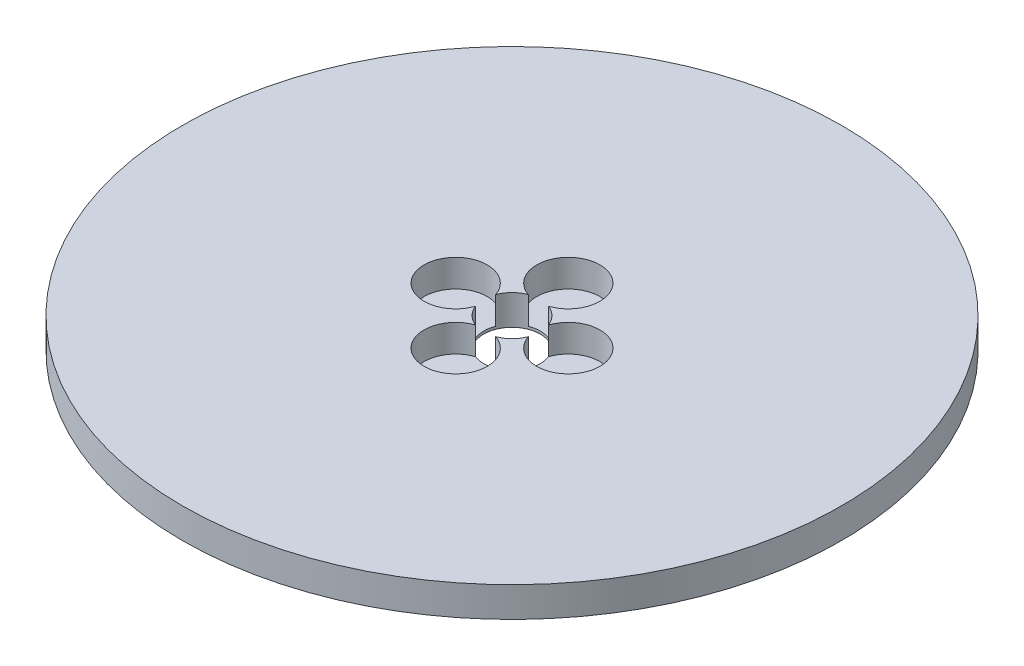
ISO-10303-21;
HEADER;
FILE_DESCRIPTION(('STEP AP214'),'2;1');
FILE_NAME('part.step','',(''),(''),'','','');
FILE_SCHEMA(('AUTOMOTIVE_DESIGN { 1 0 10303 214 1 1 1 1 }'));
ENDSEC;
DATA;
#1=APPLICATION_CONTEXT('core data for automotive mechanical design processes');
#2=APPLICATION_PROTOCOL_DEFINITION('international standard','automotive_design',2000,#1);
#3=PRODUCT_CONTEXT('',#1,'mechanical');
#4=PRODUCT('Part','Part','',(#3));
#5=PRODUCT_RELATED_PRODUCT_CATEGORY('part','',(#4));
#6=PRODUCT_DEFINITION_FORMATION('','',#4);
#7=PRODUCT_DEFINITION_CONTEXT('part definition',#1,'design');
#8=PRODUCT_DEFINITION('design','',#6,#7);
#9=PRODUCT_DEFINITION_SHAPE('','',#8);
#10=(LENGTH_UNIT() NAMED_UNIT(*) SI_UNIT(.MILLI.,.METRE.));
#11=(NAMED_UNIT(*) PLANE_ANGLE_UNIT() SI_UNIT($,.RADIAN.));
#12=(NAMED_UNIT(*) SI_UNIT($,.STERADIAN.) SOLID_ANGLE_UNIT());
#13=UNCERTAINTY_MEASURE_WITH_UNIT(LENGTH_MEASURE(1.E-05),#10,'distance_accuracy_value','');
#14=(GEOMETRIC_REPRESENTATION_CONTEXT(3) GLOBAL_UNCERTAINTY_ASSIGNED_CONTEXT((#13)) GLOBAL_UNIT_ASSIGNED_CONTEXT((#10,
#11,#12)) REPRESENTATION_CONTEXT('',''));
#15=CARTESIAN_POINT('',(0.,0.,0.));
#16=DIRECTION('',(0.,0.,1.));
#17=DIRECTION('',(1.,0.,0.));
#18=AXIS2_PLACEMENT_3D('',#15,#16,#17);
#19=CARTESIAN_POINT('',(0.,8.,0.));
#20=DIRECTION('',(0.,-1.,0.));
#21=DIRECTION('',(0.,0.,-1.));
#22=AXIS2_PLACEMENT_3D('',#19,#20,#21);
#23=CYLINDRICAL_SURFACE('',#22,87.5);
#24=CARTESIAN_POINT('',(0.,8.,0.));
#25=DIRECTION('',(0.,1.,0.));
#26=DIRECTION('',(0.,0.,1.));
#27=AXIS2_PLACEMENT_3D('',#24,#25,#26);
#28=CIRCLE('',#27,87.5);
#29=CARTESIAN_POINT('',(0.,8.,87.5));
#30=VERTEX_POINT('',#29);
#31=EDGE_CURVE('E141',#30,#30,#28,.T.);
#32=ORIENTED_EDGE('',*,*,#31,.F.);
#33=EDGE_LOOP('',(#32));
#34=FACE_BOUND('',#33,.T.);
#35=CARTESIAN_POINT('',(0.,0.,0.));
#36=DIRECTION('',(0.,1.,0.));
#37=DIRECTION('',(0.,0.,1.));
#38=AXIS2_PLACEMENT_3D('',#35,#36,#37);
#39=CIRCLE('',#38,87.5);
#40=CARTESIAN_POINT('',(0.,0.,87.5));
#41=VERTEX_POINT('',#40);
#42=EDGE_CURVE('E135',#41,#41,#39,.T.);
#43=ORIENTED_EDGE('',*,*,#42,.T.);
#44=EDGE_LOOP('',(#43));
#45=FACE_BOUND('',#44,.T.);
#46=ADVANCED_FACE('F39',(#34,#45),#23,.T.);
#47=CARTESIAN_POINT('',(0.,8.,0.));
#48=DIRECTION('',(0.,1.,0.));
#49=DIRECTION('',(0.,0.,1.));
#50=AXIS2_PLACEMENT_3D('',#47,#48,#49);
#51=PLANE('',#50);
#52=CARTESIAN_POINT('',(14.9536666820935,8.,0.));
#53=DIRECTION('',(0.,1.,0.));
#54=DIRECTION('',(0.,0.,-1.));
#55=AXIS2_PLACEMENT_3D('',#52,#53,#54);
#56=CIRCLE('',#55,8.3883222143685);
#57=CARTESIAN_POINT('',(7.00491063900573,8.,2.67978113650057));
#58=VERTEX_POINT('',#57);
#59=CARTESIAN_POINT('',(7.00491063900573,8.,-2.67978113650057));
#60=VERTEX_POINT('',#59);
#61=EDGE_CURVE('E126',#58,#60,#56,.T.);
#62=ORIENTED_EDGE('',*,*,#61,.F.);
#63=CARTESIAN_POINT('',(0.,8.,0.));
#64=DIRECTION('',(0.,1.,0.));
#65=DIRECTION('',(0.,0.,1.));
#66=AXIS2_PLACEMENT_3D('',#63,#64,#65);
#67=CIRCLE('',#66,7.5);
#68=CARTESIAN_POINT('',(2.67978113650059,8.,7.00491063900572));
#69=VERTEX_POINT('',#68);
#70=EDGE_CURVE('E121',#69,#58,#67,.T.);
#71=ORIENTED_EDGE('',*,*,#70,.F.);
#72=CARTESIAN_POINT('',(0.,8.,14.9536666820935));
#73=DIRECTION('',(0.,1.,0.));
#74=DIRECTION('',(1.,0.,0.));
#75=AXIS2_PLACEMENT_3D('',#72,#73,#74);
#76=CIRCLE('',#75,8.3883222143685);
#77=CARTESIAN_POINT('',(-2.67978113650055,8.,7.00491063900574));
#78=VERTEX_POINT('',#77);
#79=EDGE_CURVE('E105',#78,#69,#76,.T.);
#80=ORIENTED_EDGE('',*,*,#79,.F.);
#81=CARTESIAN_POINT('',(-7.00491063900573,8.,2.67978113650057));
#82=VERTEX_POINT('',#81);
#83=EDGE_CURVE('E129',#82,#78,#67,.T.);
#84=ORIENTED_EDGE('',*,*,#83,.F.);
#85=CARTESIAN_POINT('',(-14.9536666820935,8.,0.));
#86=DIRECTION('',(0.,1.,0.));
#87=DIRECTION('',(0.,0.,1.));
#88=AXIS2_PLACEMENT_3D('',#85,#86,#87);
#89=CIRCLE('',#88,8.3883222143685);
#90=CARTESIAN_POINT('',(-7.00491063900573,8.,-2.67978113650057));
#91=VERTEX_POINT('',#90);
#92=EDGE_CURVE('E140',#91,#82,#89,.T.);
#93=ORIENTED_EDGE('',*,*,#92,.F.);
#94=CARTESIAN_POINT('',(-2.67978113650064,8.,-7.00491063900571));
#95=VERTEX_POINT('',#94);
#96=EDGE_CURVE('E132',#95,#91,#67,.T.);
#97=ORIENTED_EDGE('',*,*,#96,.F.);
#98=CARTESIAN_POINT('',(-1.56631344503429E-13,8.,-14.9536666820935));
#99=DIRECTION('',(0.,1.,0.));
#100=DIRECTION('',(-1.,0.,0.));
#101=AXIS2_PLACEMENT_3D('',#98,#99,#100);
#102=CIRCLE('',#101,8.3883222143685);
#103=CARTESIAN_POINT('',(2.6797811365005,8.,-7.00491063900576));
#104=VERTEX_POINT('',#103);
#105=EDGE_CURVE('E226',#104,#95,#102,.T.);
#106=ORIENTED_EDGE('',*,*,#105,.F.);
#107=EDGE_CURVE('E128',#60,#104,#67,.T.);
#108=ORIENTED_EDGE('',*,*,#107,.F.);
#109=EDGE_LOOP('',(#62,#71,#80,#84,#93,#97,#106,#108));
#110=FACE_BOUND('',#109,.T.);
#111=ORIENTED_EDGE('',*,*,#31,.T.);
#112=EDGE_LOOP('',(#111));
#113=FACE_BOUND('',#112,.T.);
#114=ADVANCED_FACE('F124',(#110,#113),#51,.T.);
#115=CARTESIAN_POINT('',(0.,0.,0.));
#116=DIRECTION('',(0.,1.,0.));
#117=DIRECTION('',(0.,0.,1.));
#118=AXIS2_PLACEMENT_3D('',#115,#116,#117);
#119=PLANE('',#118);
#120=CARTESIAN_POINT('',(0.,0.,0.));
#121=DIRECTION('',(0.,1.,0.));
#122=DIRECTION('',(0.,0.,1.));
#123=AXIS2_PLACEMENT_3D('',#120,#121,#122);
#124=CIRCLE('',#123,7.5);
#125=CARTESIAN_POINT('',(0.,0.,7.5));
#126=VERTEX_POINT('',#125);
#127=EDGE_CURVE('E138',#126,#126,#124,.T.);
#128=ORIENTED_EDGE('',*,*,#127,.T.);
#129=EDGE_LOOP('',(#128));
#130=FACE_BOUND('',#129,.T.);
#131=ORIENTED_EDGE('',*,*,#42,.F.);
#132=EDGE_LOOP('',(#131));
#133=FACE_BOUND('',#132,.T.);
#134=ADVANCED_FACE('F186',(#130,#133),#119,.F.);
#135=CARTESIAN_POINT('',(0.,8.,0.));
#136=DIRECTION('',(0.,-1.,0.));
#137=DIRECTION('',(0.,0.,-1.));
#138=AXIS2_PLACEMENT_3D('',#135,#136,#137);
#139=CYLINDRICAL_SURFACE('',#138,7.5);
#140=DIRECTION('',(0.,1.,0.));
#141=VECTOR('',#140,1.);
#142=CARTESIAN_POINT('',(7.00491063900573,4.35345535176546,2.67978113650057));
#143=LINE('',#142,#141);
#144=CARTESIAN_POINT('',(7.00491063900573,0.706910703530914,2.67978113650057));
#145=VERTEX_POINT('',#144);
#146=EDGE_CURVE('E11',#145,#58,#143,.T.);
#147=ORIENTED_EDGE('',*,*,#146,.F.);
#148=CARTESIAN_POINT('',(0.,0.706910703530914,0.));
#149=DIRECTION('',(0.,1.,0.));
#150=DIRECTION('',(0.,0.,1.));
#151=AXIS2_PLACEMENT_3D('',#148,#149,#150);
#152=CIRCLE('',#151,7.5);
#153=CARTESIAN_POINT('',(7.00491063900573,0.706910703530914,-2.67978113650057));
#154=VERTEX_POINT('',#153);
#155=EDGE_CURVE('E167',#145,#154,#152,.T.);
#156=ORIENTED_EDGE('',*,*,#155,.T.);
#157=DIRECTION('',(0.,1.,0.));
#158=VECTOR('',#157,1.);
#159=CARTESIAN_POINT('',(7.00491063900573,4.35345535176546,-2.67978113650057));
#160=LINE('',#159,#158);
#161=EDGE_CURVE('E46',#60,#154,#160,.F.);
#162=ORIENTED_EDGE('',*,*,#161,.F.);
#163=ORIENTED_EDGE('',*,*,#107,.T.);
#164=DIRECTION('',(0.,1.,0.));
#165=VECTOR('',#164,1.);
#166=CARTESIAN_POINT('',(2.6797811365005,4.35345535176546,-7.00491063900576));
#167=LINE('',#166,#165);
#168=CARTESIAN_POINT('',(2.6797811365005,0.706910703530914,-7.00491063900576));
#169=VERTEX_POINT('',#168);
#170=EDGE_CURVE('E163',#169,#104,#167,.T.);
#171=ORIENTED_EDGE('',*,*,#170,.F.);
#172=CARTESIAN_POINT('',(0.,0.706910703530914,0.));
#173=DIRECTION('',(0.,1.,0.));
#174=DIRECTION('',(0.,0.,1.));
#175=AXIS2_PLACEMENT_3D('',#172,#173,#174);
#176=CIRCLE('',#175,7.5);
#177=CARTESIAN_POINT('',(-2.67978113650064,0.706910703530914,-7.00491063900571));
#178=VERTEX_POINT('',#177);
#179=EDGE_CURVE('E157',#169,#178,#176,.T.);
#180=ORIENTED_EDGE('',*,*,#179,.T.);
#181=DIRECTION('',(0.,1.,0.));
#182=VECTOR('',#181,1.);
#183=CARTESIAN_POINT('',(-2.67978113650064,4.35345535176546,-7.00491063900571));
#184=LINE('',#183,#182);
#185=EDGE_CURVE('E165',#95,#178,#184,.F.);
#186=ORIENTED_EDGE('',*,*,#185,.F.);
#187=ORIENTED_EDGE('',*,*,#96,.T.);
#188=DIRECTION('',(0.,1.,0.));
#189=VECTOR('',#188,1.);
#190=CARTESIAN_POINT('',(-7.00491063900573,4.35345535176546,-2.67978113650057));
#191=LINE('',#190,#189);
#192=CARTESIAN_POINT('',(-7.00491063900573,0.706910703530914,-2.67978113650057));
#193=VERTEX_POINT('',#192);
#194=EDGE_CURVE('E152',#193,#91,#191,.T.);
#195=ORIENTED_EDGE('',*,*,#194,.F.);
#196=CARTESIAN_POINT('',(0.,0.706910703530914,0.));
#197=DIRECTION('',(0.,1.,0.));
#198=DIRECTION('',(0.,0.,1.));
#199=AXIS2_PLACEMENT_3D('',#196,#197,#198);
#200=CIRCLE('',#199,7.5);
#201=CARTESIAN_POINT('',(-7.00491063900573,0.706910703530914,2.67978113650057));
#202=VERTEX_POINT('',#201);
#203=EDGE_CURVE('E148',#193,#202,#200,.T.);
#204=ORIENTED_EDGE('',*,*,#203,.T.);
#205=DIRECTION('',(0.,1.,0.));
#206=VECTOR('',#205,1.);
#207=CARTESIAN_POINT('',(-7.00491063900573,4.35345535176546,2.67978113650057));
#208=LINE('',#207,#206);
#209=EDGE_CURVE('E151',#82,#202,#208,.F.);
#210=ORIENTED_EDGE('',*,*,#209,.F.);
#211=ORIENTED_EDGE('',*,*,#83,.T.);
#212=DIRECTION('',(0.,1.,0.));
#213=VECTOR('',#212,1.);
#214=CARTESIAN_POINT('',(-2.67978113650055,4.35345535176546,7.00491063900574));
#215=LINE('',#214,#213);
#216=CARTESIAN_POINT('',(-2.67978113650055,0.706910703530914,7.00491063900574));
#217=VERTEX_POINT('',#216);
#218=EDGE_CURVE('E108',#217,#78,#215,.T.);
#219=ORIENTED_EDGE('',*,*,#218,.F.);
#220=CARTESIAN_POINT('',(0.,0.706910703530914,0.));
#221=DIRECTION('',(0.,1.,0.));
#222=DIRECTION('',(0.,0.,1.));
#223=AXIS2_PLACEMENT_3D('',#220,#221,#222);
#224=CIRCLE('',#223,7.5);
#225=CARTESIAN_POINT('',(2.67978113650059,0.706910703530914,7.00491063900572));
#226=VERTEX_POINT('',#225);
#227=EDGE_CURVE('E125',#217,#226,#224,.T.);
#228=ORIENTED_EDGE('',*,*,#227,.T.);
#229=DIRECTION('',(0.,1.,0.));
#230=VECTOR('',#229,1.);
#231=CARTESIAN_POINT('',(2.67978113650059,4.35345535176546,7.00491063900572));
#232=LINE('',#231,#230);
#233=EDGE_CURVE('E106',#69,#226,#232,.F.);
#234=ORIENTED_EDGE('',*,*,#233,.F.);
#235=ORIENTED_EDGE('',*,*,#70,.T.);
#236=EDGE_LOOP('',(#147,#156,#162,#163,#171,#180,#186,#187,#195,#204,#210,#211,#219,#228,#234,#235));
#237=FACE_BOUND('',#236,.T.);
#238=ORIENTED_EDGE('',*,*,#127,.F.);
#239=EDGE_LOOP('',(#238));
#240=FACE_BOUND('',#239,.T.);
#241=ADVANCED_FACE('F118',(#237,#240),#139,.F.);
#242=CARTESIAN_POINT('',(-14.9536666820935,0.706910703530914,0.));
#243=DIRECTION('',(0.,1.,0.));
#244=DIRECTION('',(0.,0.,1.));
#245=AXIS2_PLACEMENT_3D('',#242,#243,#244);
#246=CYLINDRICAL_SURFACE('',#245,8.3883222143685);
#247=ORIENTED_EDGE('',*,*,#194,.T.);
#248=ORIENTED_EDGE('',*,*,#92,.T.);
#249=ORIENTED_EDGE('',*,*,#209,.T.);
#250=CARTESIAN_POINT('',(-14.9536666820935,0.706910703530914,0.));
#251=DIRECTION('',(0.,1.,0.));
#252=DIRECTION('',(0.,0.,1.));
#253=AXIS2_PLACEMENT_3D('',#250,#251,#252);
#254=CIRCLE('',#253,8.3883222143685);
#255=EDGE_CURVE('E142',#193,#202,#254,.T.);
#256=ORIENTED_EDGE('',*,*,#255,.F.);
#257=EDGE_LOOP('',(#247,#248,#249,#256));
#258=FACE_BOUND('',#257,.T.);
#259=ADVANCED_FACE('F197',(#258),#246,.F.);
#260=CARTESIAN_POINT('',(-14.9536666820935,0.706910703530914,0.));
#261=DIRECTION('',(0.,1.,0.));
#262=DIRECTION('',(0.,0.,1.));
#263=AXIS2_PLACEMENT_3D('',#260,#261,#262);
#264=PLANE('',#263);
#265=ORIENTED_EDGE('',*,*,#255,.T.);
#266=ORIENTED_EDGE('',*,*,#203,.F.);
#267=EDGE_LOOP('',(#265,#266));
#268=FACE_BOUND('',#267,.T.);
#269=ADVANCED_FACE('F203',(#268),#264,.T.);
#270=CARTESIAN_POINT('',(0.,0.706910703530914,14.9536666820935));
#271=DIRECTION('',(0.,1.,0.));
#272=DIRECTION('',(0.,0.,1.));
#273=AXIS2_PLACEMENT_3D('',#270,#271,#272);
#274=CYLINDRICAL_SURFACE('',#273,8.3883222143685);
#275=ORIENTED_EDGE('',*,*,#218,.T.);
#276=ORIENTED_EDGE('',*,*,#79,.T.);
#277=ORIENTED_EDGE('',*,*,#233,.T.);
#278=CARTESIAN_POINT('',(0.,0.706910703530914,14.9536666820935));
#279=DIRECTION('',(0.,1.,0.));
#280=DIRECTION('',(1.,0.,0.));
#281=AXIS2_PLACEMENT_3D('',#278,#279,#280);
#282=CIRCLE('',#281,8.3883222143685);
#283=EDGE_CURVE('E111',#217,#226,#282,.T.);
#284=ORIENTED_EDGE('',*,*,#283,.F.);
#285=EDGE_LOOP('',(#275,#276,#277,#284));
#286=FACE_BOUND('',#285,.T.);
#287=ADVANCED_FACE('F102',(#286),#274,.F.);
#288=CARTESIAN_POINT('',(0.,0.706910703530914,14.9536666820935));
#289=DIRECTION('',(0.,1.,0.));
#290=DIRECTION('',(1.,0.,0.));
#291=AXIS2_PLACEMENT_3D('',#288,#289,#290);
#292=PLANE('',#291);
#293=ORIENTED_EDGE('',*,*,#283,.T.);
#294=ORIENTED_EDGE('',*,*,#227,.F.);
#295=EDGE_LOOP('',(#293,#294));
#296=FACE_BOUND('',#295,.T.);
#297=ADVANCED_FACE('F208',(#296),#292,.T.);
#298=CARTESIAN_POINT('',(-1.56631344503429E-13,0.706910703530914,-14.9536666820935));
#299=DIRECTION('',(0.,1.,0.));
#300=DIRECTION('',(0.,0.,1.));
#301=AXIS2_PLACEMENT_3D('',#298,#299,#300);
#302=CYLINDRICAL_SURFACE('',#301,8.3883222143685);
#303=ORIENTED_EDGE('',*,*,#170,.T.);
#304=ORIENTED_EDGE('',*,*,#105,.T.);
#305=ORIENTED_EDGE('',*,*,#185,.T.);
#306=CARTESIAN_POINT('',(-1.56631344503429E-13,0.706910703530914,-14.9536666820935));
#307=DIRECTION('',(0.,1.,0.));
#308=DIRECTION('',(-1.,0.,0.));
#309=AXIS2_PLACEMENT_3D('',#306,#307,#308);
#310=CIRCLE('',#309,8.3883222143685);
#311=EDGE_CURVE('E56',#169,#178,#310,.T.);
#312=ORIENTED_EDGE('',*,*,#311,.F.);
#313=EDGE_LOOP('',(#303,#304,#305,#312));
#314=FACE_BOUND('',#313,.T.);
#315=ADVANCED_FACE('F209',(#314),#302,.F.);
#316=CARTESIAN_POINT('',(-1.56631344503429E-13,0.706910703530914,-14.9536666820935));
#317=DIRECTION('',(0.,1.,0.));
#318=DIRECTION('',(-1.,0.,0.));
#319=AXIS2_PLACEMENT_3D('',#316,#317,#318);
#320=PLANE('',#319);
#321=ORIENTED_EDGE('',*,*,#311,.T.);
#322=ORIENTED_EDGE('',*,*,#179,.F.);
#323=EDGE_LOOP('',(#321,#322));
#324=FACE_BOUND('',#323,.T.);
#325=ADVANCED_FACE('F180',(#324),#320,.T.);
#326=CARTESIAN_POINT('',(14.9536666820935,0.706910703530914,0.));
#327=DIRECTION('',(0.,1.,0.));
#328=DIRECTION('',(0.,0.,1.));
#329=AXIS2_PLACEMENT_3D('',#326,#327,#328);
#330=CYLINDRICAL_SURFACE('',#329,8.3883222143685);
#331=ORIENTED_EDGE('',*,*,#146,.T.);
#332=ORIENTED_EDGE('',*,*,#61,.T.);
#333=ORIENTED_EDGE('',*,*,#161,.T.);
#334=CARTESIAN_POINT('',(14.9536666820935,0.706910703530914,0.));
#335=DIRECTION('',(0.,1.,0.));
#336=DIRECTION('',(0.,0.,-1.));
#337=AXIS2_PLACEMENT_3D('',#334,#335,#336);
#338=CIRCLE('',#337,8.3883222143685);
#339=EDGE_CURVE('E55',#145,#154,#338,.T.);
#340=ORIENTED_EDGE('',*,*,#339,.F.);
#341=EDGE_LOOP('',(#331,#332,#333,#340));
#342=FACE_BOUND('',#341,.T.);
#343=ADVANCED_FACE('F168',(#342),#330,.F.);
#344=CARTESIAN_POINT('',(14.9536666820935,0.706910703530914,0.));
#345=DIRECTION('',(0.,1.,0.));
#346=DIRECTION('',(0.,0.,-1.));
#347=AXIS2_PLACEMENT_3D('',#344,#345,#346);
#348=PLANE('',#347);
#349=ORIENTED_EDGE('',*,*,#339,.T.);
#350=ORIENTED_EDGE('',*,*,#155,.F.);
#351=EDGE_LOOP('',(#349,#350));
#352=FACE_BOUND('',#351,.T.);
#353=ADVANCED_FACE('F171',(#352),#348,.T.);
#354=CLOSED_SHELL('',(#46,#114,#134,#241,#259,#269,#287,#297,#315,#325,#343,#353));
#355=MANIFOLD_SOLID_BREP('B2',#354);
#356=ADVANCED_BREP_SHAPE_REPRESENTATION('',(#18,#355),#14);
#357=SHAPE_DEFINITION_REPRESENTATION(#9,#356);
ENDSEC;
END-ISO-10303-21;
